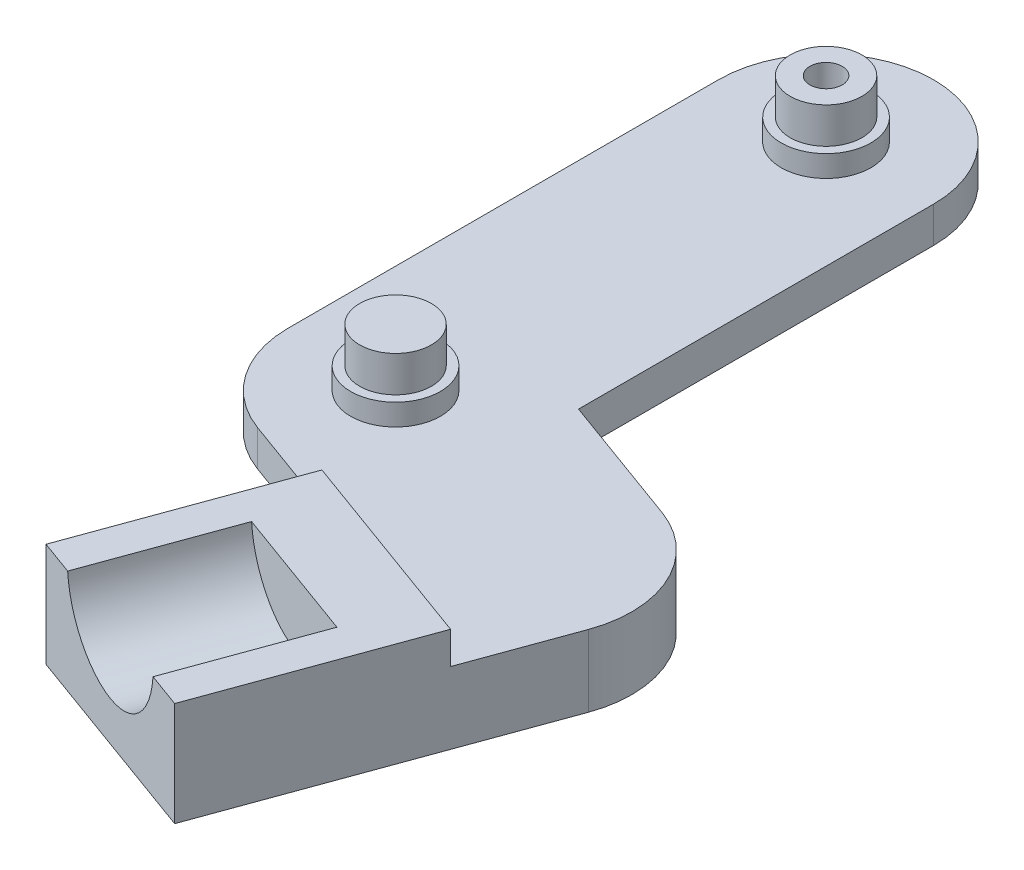
ISO-10303-21;
HEADER;
FILE_DESCRIPTION(('STEP AP214'),'2;1');
FILE_NAME('part.step','',(''),(''),'','','');
FILE_SCHEMA(('AUTOMOTIVE_DESIGN { 1 0 10303 214 1 1 1 1 }'));
ENDSEC;
DATA;
#1=APPLICATION_CONTEXT('core data for automotive mechanical design processes');
#2=APPLICATION_PROTOCOL_DEFINITION('international standard','automotive_design',2000,#1);
#3=PRODUCT_CONTEXT('',#1,'mechanical');
#4=PRODUCT('Part','Part','',(#3));
#5=PRODUCT_RELATED_PRODUCT_CATEGORY('part','',(#4));
#6=PRODUCT_DEFINITION_FORMATION('','',#4);
#7=PRODUCT_DEFINITION_CONTEXT('part definition',#1,'design');
#8=PRODUCT_DEFINITION('design','',#6,#7);
#9=PRODUCT_DEFINITION_SHAPE('','',#8);
#10=(LENGTH_UNIT() NAMED_UNIT(*) SI_UNIT(.MILLI.,.METRE.));
#11=(NAMED_UNIT(*) PLANE_ANGLE_UNIT() SI_UNIT($,.RADIAN.));
#12=(NAMED_UNIT(*) SI_UNIT($,.STERADIAN.) SOLID_ANGLE_UNIT());
#13=UNCERTAINTY_MEASURE_WITH_UNIT(LENGTH_MEASURE(1.E-05),#10,'distance_accuracy_value','');
#14=(GEOMETRIC_REPRESENTATION_CONTEXT(3) GLOBAL_UNCERTAINTY_ASSIGNED_CONTEXT((#13)) GLOBAL_UNIT_ASSIGNED_CONTEXT((#10,
#11,#12)) REPRESENTATION_CONTEXT('',''));
#15=CARTESIAN_POINT('',(0.,0.,0.));
#16=DIRECTION('',(0.,0.,1.));
#17=DIRECTION('',(1.,0.,0.));
#18=AXIS2_PLACEMENT_3D('',#15,#16,#17);
#19=CARTESIAN_POINT('',(0.,5.,-60.));
#20=DIRECTION('',(0.,1.,0.));
#21=DIRECTION('',(0.,0.,1.));
#22=AXIS2_PLACEMENT_3D('',#19,#20,#21);
#23=PLANE('',#22);
#24=CARTESIAN_POINT('',(0.,5.,0.));
#25=DIRECTION('',(0.,1.,0.));
#26=DIRECTION('',(0.,0.,1.));
#27=AXIS2_PLACEMENT_3D('',#24,#25,#26);
#28=CIRCLE('',#27,6.25000000000001);
#29=CARTESIAN_POINT('',(0.,5.,6.25000000000001));
#30=VERTEX_POINT('',#29);
#31=EDGE_CURVE('E241',#30,#30,#28,.T.);
#32=ORIENTED_EDGE('',*,*,#31,.F.);
#33=EDGE_LOOP('',(#32));
#34=FACE_BOUND('',#33,.T.);
#35=CARTESIAN_POINT('',(0.,5.,-60.));
#36=DIRECTION('',(0.,1.,0.));
#37=DIRECTION('',(0.,0.,1.));
#38=AXIS2_PLACEMENT_3D('',#35,#36,#37);
#39=CIRCLE('',#38,6.25000000000001);
#40=CARTESIAN_POINT('',(0.,5.,-53.75));
#41=VERTEX_POINT('',#40);
#42=EDGE_CURVE('E248',#41,#41,#39,.T.);
#43=ORIENTED_EDGE('',*,*,#42,.F.);
#44=EDGE_LOOP('',(#43));
#45=FACE_BOUND('',#44,.T.);
#46=DIRECTION('',(-0.939692620785907,0.,-0.342020143325673));
#47=VECTOR('',#46,1.);
#48=CARTESIAN_POINT('',(-5.13030214988509,5.,14.0953893117886));
#49=LINE('',#48,#47);
#50=CARTESIAN_POINT('',(8.96508716190355,5.,19.2256914616737));
#51=VERTEX_POINT('',#50);
#52=CARTESIAN_POINT('',(-5.13030214988509,5.,14.0953893117886));
#53=VERTEX_POINT('',#52);
#54=EDGE_CURVE('E206',#51,#53,#49,.T.);
#55=ORIENTED_EDGE('',*,*,#54,.F.);
#56=DIRECTION('',(-0.939692620785908,0.,-0.34202014332567));
#57=VECTOR('',#56,1.);
#58=CARTESIAN_POINT('',(8.96508716190355,5.,19.2256914616737));
#59=LINE('',#58,#57);
#60=CARTESIAN_POINT('',(37.1558657854808,5.,29.4862957614438));
#61=VERTEX_POINT('',#60);
#62=EDGE_CURVE('E163',#61,#51,#59,.T.);
#63=ORIENTED_EDGE('',*,*,#62,.F.);
#64=DIRECTION('',(-0.34202014332567,0.,0.939692620785908));
#65=VECTOR('',#64,1.);
#66=CARTESIAN_POINT('',(42.2861679353658,5.,15.3909064496552));
#67=LINE('',#66,#65);
#68=CARTESIAN_POINT('',(42.2861679353658,5.,15.3909064496552));
#69=VERTEX_POINT('',#68);
#70=EDGE_CURVE('E174',#69,#61,#67,.T.);
#71=ORIENTED_EDGE('',*,*,#70,.F.);
#72=CARTESIAN_POINT('',(28.1907786235772,5.,10.2606042997702));
#73=DIRECTION('',(0.,-1.,0.));
#74=DIRECTION('',(0.,0.,-1.));
#75=AXIS2_PLACEMENT_3D('',#72,#73,#74);
#76=CIRCLE('',#75,15.);
#77=CARTESIAN_POINT('',(33.3210807734623,5.,-3.83478501201842));
#78=VERTEX_POINT('',#77);
#79=EDGE_CURVE('E202',#78,#69,#76,.T.);
#80=ORIENTED_EDGE('',*,*,#79,.F.);
#81=DIRECTION('',(0.939692620785907,0.,0.342020143325673));
#82=VECTOR('',#81,1.);
#83=CARTESIAN_POINT('',(15.,5.,-10.5031130731456));
#84=LINE('',#83,#82);
#85=CARTESIAN_POINT('',(15.,5.,-10.5031130731456));
#86=VERTEX_POINT('',#85);
#87=EDGE_CURVE('E199',#86,#78,#84,.T.);
#88=ORIENTED_EDGE('',*,*,#87,.F.);
#89=DIRECTION('',(0.,0.,-1.));
#90=VECTOR('',#89,1.);
#91=CARTESIAN_POINT('',(15.,5.,0.));
#92=LINE('',#91,#90);
#93=CARTESIAN_POINT('',(15.,5.,-60.));
#94=VERTEX_POINT('',#93);
#95=EDGE_CURVE('E257',#86,#94,#92,.T.);
#96=ORIENTED_EDGE('',*,*,#95,.T.);
#97=CARTESIAN_POINT('',(0.,5.,-60.));
#98=DIRECTION('',(0.,1.,0.));
#99=DIRECTION('',(0.,0.,1.));
#100=AXIS2_PLACEMENT_3D('',#97,#98,#99);
#101=CIRCLE('',#100,15.);
#102=CARTESIAN_POINT('',(-15.,5.,-60.));
#103=VERTEX_POINT('',#102);
#104=EDGE_CURVE('E259',#94,#103,#101,.T.);
#105=ORIENTED_EDGE('',*,*,#104,.T.);
#106=DIRECTION('',(0.,0.,-1.));
#107=VECTOR('',#106,1.);
#108=CARTESIAN_POINT('',(-15.,5.,0.));
#109=LINE('',#108,#107);
#110=CARTESIAN_POINT('',(-15.,5.,0.));
#111=VERTEX_POINT('',#110);
#112=EDGE_CURVE('E262',#111,#103,#109,.T.);
#113=ORIENTED_EDGE('',*,*,#112,.F.);
#114=CARTESIAN_POINT('',(0.,5.,0.));
#115=DIRECTION('',(0.,1.,0.));
#116=DIRECTION('',(0.,0.,1.));
#117=AXIS2_PLACEMENT_3D('',#114,#115,#116);
#118=CIRCLE('',#117,15.);
#119=EDGE_CURVE('E265',#111,#53,#118,.T.);
#120=ORIENTED_EDGE('',*,*,#119,.T.);
#121=EDGE_LOOP('',(#55,#63,#71,#80,#88,#96,#105,#113,#120));
#122=FACE_BOUND('',#121,.T.);
#123=ADVANCED_FACE('F35',(#34,#45,#122),#23,.T.);
#124=CARTESIAN_POINT('',(0.,0.,-60.));
#125=DIRECTION('',(0.,1.,0.));
#126=DIRECTION('',(0.,0.,1.));
#127=AXIS2_PLACEMENT_3D('',#124,#125,#126);
#128=PLANE('',#127);
#129=CARTESIAN_POINT('',(0.,0.,-60.));
#130=DIRECTION('',(0.,-1.,0.));
#131=DIRECTION('',(0.,0.,-1.));
#132=AXIS2_PLACEMENT_3D('',#129,#130,#131);
#133=CIRCLE('',#132,4.49999999999999);
#134=CARTESIAN_POINT('',(0.,0.,-64.5));
#135=VERTEX_POINT('',#134);
#136=EDGE_CURVE('E214',#135,#135,#133,.T.);
#137=ORIENTED_EDGE('',*,*,#136,.F.);
#138=EDGE_LOOP('',(#137));
#139=FACE_BOUND('',#138,.T.);
#140=CARTESIAN_POINT('',(28.1907786235772,0.,10.2606042997702));
#141=DIRECTION('',(0.,1.,0.));
#142=DIRECTION('',(0.,0.,1.));
#143=AXIS2_PLACEMENT_3D('',#140,#141,#142);
#144=CIRCLE('',#143,15.);
#145=CARTESIAN_POINT('',(14.0953893117886,0.,5.13030214988514));
#146=VERTEX_POINT('',#145);
#147=CARTESIAN_POINT('',(33.3210807734623,0.,-3.83478501201842));
#148=VERTEX_POINT('',#147);
#149=EDGE_CURVE('E57',#146,#148,#144,.F.);
#150=ORIENTED_EDGE('',*,*,#149,.F.);
#151=DIRECTION('',(0.342020143325669,0.,-0.939692620785908));
#152=VECTOR('',#151,1.);
#153=CARTESIAN_POINT('',(33.3790176023848,0.,-47.8510311436843));
#154=LINE('',#153,#152);
#155=CARTESIAN_POINT('',(8.96508716190356,0.,19.2256914616737));
#156=VERTEX_POINT('',#155);
#157=EDGE_CURVE('E196',#156,#146,#154,.T.);
#158=ORIENTED_EDGE('',*,*,#157,.F.);
#159=DIRECTION('',(-0.939692620785907,0.,-0.342020143325673));
#160=VECTOR('',#159,1.);
#161=CARTESIAN_POINT('',(-5.13030214988509,0.,14.0953893117886));
#162=LINE('',#161,#160);
#163=CARTESIAN_POINT('',(-5.13030214988509,0.,14.0953893117886));
#164=VERTEX_POINT('',#163);
#165=EDGE_CURVE('E203',#156,#164,#162,.T.);
#166=ORIENTED_EDGE('',*,*,#165,.T.);
#167=CARTESIAN_POINT('',(0.,0.,0.));
#168=DIRECTION('',(0.,1.,0.));
#169=DIRECTION('',(0.,0.,1.));
#170=AXIS2_PLACEMENT_3D('',#167,#168,#169);
#171=CIRCLE('',#170,15.);
#172=CARTESIAN_POINT('',(-15.,0.,0.));
#173=VERTEX_POINT('',#172);
#174=EDGE_CURVE('E260',#173,#164,#171,.T.);
#175=ORIENTED_EDGE('',*,*,#174,.F.);
#176=DIRECTION('',(0.,0.,-1.));
#177=VECTOR('',#176,1.);
#178=CARTESIAN_POINT('',(-15.,0.,0.));
#179=LINE('',#178,#177);
#180=CARTESIAN_POINT('',(-15.,0.,-60.));
#181=VERTEX_POINT('',#180);
#182=EDGE_CURVE('E273',#173,#181,#179,.T.);
#183=ORIENTED_EDGE('',*,*,#182,.T.);
#184=CARTESIAN_POINT('',(0.,0.,-60.));
#185=DIRECTION('',(0.,1.,0.));
#186=DIRECTION('',(0.,0.,1.));
#187=AXIS2_PLACEMENT_3D('',#184,#185,#186);
#188=CIRCLE('',#187,15.);
#189=CARTESIAN_POINT('',(15.,0.,-60.));
#190=VERTEX_POINT('',#189);
#191=EDGE_CURVE('E270',#190,#181,#188,.T.);
#192=ORIENTED_EDGE('',*,*,#191,.F.);
#193=DIRECTION('',(0.,0.,-1.));
#194=VECTOR('',#193,1.);
#195=CARTESIAN_POINT('',(15.,0.,0.));
#196=LINE('',#195,#194);
#197=CARTESIAN_POINT('',(15.,0.,-10.5031130731456));
#198=VERTEX_POINT('',#197);
#199=EDGE_CURVE('E254',#198,#190,#196,.T.);
#200=ORIENTED_EDGE('',*,*,#199,.F.);
#201=DIRECTION('',(0.939692620785907,0.,0.342020143325673));
#202=VECTOR('',#201,1.);
#203=CARTESIAN_POINT('',(15.,0.,-10.5031130731456));
#204=LINE('',#203,#202);
#205=EDGE_CURVE('E198',#198,#148,#204,.T.);
#206=ORIENTED_EDGE('',*,*,#205,.T.);
#207=EDGE_LOOP('',(#150,#158,#166,#175,#183,#192,#200,#206));
#208=FACE_BOUND('',#207,.T.);
#209=ADVANCED_FACE('F323',(#139,#208),#128,.F.);
#210=CARTESIAN_POINT('',(-5.13030214988509,5.,14.0953893117886));
#211=DIRECTION('',(-0.342020143325673,0.,0.939692620785907));
#212=DIRECTION('',(0.939692620785907,0.,0.342020143325673));
#213=AXIS2_PLACEMENT_3D('',#210,#211,#212);
#214=PLANE('',#213);
#215=ORIENTED_EDGE('',*,*,#165,.F.);
#216=DIRECTION('',(0.,1.,0.));
#217=VECTOR('',#216,1.);
#218=CARTESIAN_POINT('',(8.96508716190356,5.,19.2256914616737));
#219=LINE('',#218,#217);
#220=EDGE_CURVE('E237',#156,#51,#219,.T.);
#221=ORIENTED_EDGE('',*,*,#220,.T.);
#222=ORIENTED_EDGE('',*,*,#54,.T.);
#223=DIRECTION('',(0.,-1.,0.));
#224=VECTOR('',#223,1.);
#225=CARTESIAN_POINT('',(-5.13030214988509,5.,14.0953893117886));
#226=LINE('',#225,#224);
#227=EDGE_CURVE('E211',#53,#164,#226,.T.);
#228=ORIENTED_EDGE('',*,*,#227,.T.);
#229=EDGE_LOOP('',(#215,#221,#222,#228));
#230=FACE_BOUND('',#229,.T.);
#231=ADVANCED_FACE('F318',(#230),#214,.T.);
#232=CARTESIAN_POINT('',(0.,5.,0.));
#233=DIRECTION('',(0.,-1.,0.));
#234=DIRECTION('',(0.,0.,-1.));
#235=AXIS2_PLACEMENT_3D('',#232,#233,#234);
#236=CYLINDRICAL_SURFACE('',#235,15.);
#237=ORIENTED_EDGE('',*,*,#227,.F.);
#238=ORIENTED_EDGE('',*,*,#119,.F.);
#239=DIRECTION('',(0.,-1.,0.));
#240=VECTOR('',#239,1.);
#241=CARTESIAN_POINT('',(-15.,5.,0.));
#242=LINE('',#241,#240);
#243=EDGE_CURVE('E268',#111,#173,#242,.T.);
#244=ORIENTED_EDGE('',*,*,#243,.T.);
#245=ORIENTED_EDGE('',*,*,#174,.T.);
#246=EDGE_LOOP('',(#237,#238,#244,#245));
#247=FACE_BOUND('',#246,.T.);
#248=ADVANCED_FACE('F320',(#247),#236,.T.);
#249=CARTESIAN_POINT('',(15.,5.,0.));
#250=DIRECTION('',(-1.,0.,0.));
#251=DIRECTION('',(0.,0.,1.));
#252=AXIS2_PLACEMENT_3D('',#249,#250,#251);
#253=PLANE('',#252);
#254=ORIENTED_EDGE('',*,*,#95,.F.);
#255=DIRECTION('',(0.,-1.,0.));
#256=VECTOR('',#255,1.);
#257=CARTESIAN_POINT('',(15.,5.,-10.5031130731456));
#258=LINE('',#257,#256);
#259=EDGE_CURVE('E208',#86,#198,#258,.T.);
#260=ORIENTED_EDGE('',*,*,#259,.T.);
#261=ORIENTED_EDGE('',*,*,#199,.T.);
#262=DIRECTION('',(0.,-1.,0.));
#263=VECTOR('',#262,1.);
#264=CARTESIAN_POINT('',(15.,5.,-60.));
#265=LINE('',#264,#263);
#266=EDGE_CURVE('E244',#94,#190,#265,.T.);
#267=ORIENTED_EDGE('',*,*,#266,.F.);
#268=EDGE_LOOP('',(#254,#260,#261,#267));
#269=FACE_BOUND('',#268,.T.);
#270=ADVANCED_FACE('F37',(#269),#253,.F.);
#271=CARTESIAN_POINT('',(0.,5.,-60.));
#272=DIRECTION('',(0.,-1.,0.));
#273=DIRECTION('',(0.,0.,-1.));
#274=AXIS2_PLACEMENT_3D('',#271,#272,#273);
#275=CYLINDRICAL_SURFACE('',#274,15.);
#276=ORIENTED_EDGE('',*,*,#191,.T.);
#277=DIRECTION('',(0.,-1.,0.));
#278=VECTOR('',#277,1.);
#279=CARTESIAN_POINT('',(-15.,5.,-60.));
#280=LINE('',#279,#278);
#281=EDGE_CURVE('E279',#103,#181,#280,.T.);
#282=ORIENTED_EDGE('',*,*,#281,.F.);
#283=ORIENTED_EDGE('',*,*,#104,.F.);
#284=ORIENTED_EDGE('',*,*,#266,.T.);
#285=EDGE_LOOP('',(#276,#282,#283,#284));
#286=FACE_BOUND('',#285,.T.);
#287=ADVANCED_FACE('F330',(#286),#275,.T.);
#288=CARTESIAN_POINT('',(-15.,5.,0.));
#289=DIRECTION('',(-1.,0.,0.));
#290=DIRECTION('',(0.,0.,1.));
#291=AXIS2_PLACEMENT_3D('',#288,#289,#290);
#292=PLANE('',#291);
#293=ORIENTED_EDGE('',*,*,#182,.F.);
#294=ORIENTED_EDGE('',*,*,#243,.F.);
#295=ORIENTED_EDGE('',*,*,#112,.T.);
#296=ORIENTED_EDGE('',*,*,#281,.T.);
#297=EDGE_LOOP('',(#293,#294,#295,#296));
#298=FACE_BOUND('',#297,.T.);
#299=ADVANCED_FACE('F326',(#298),#292,.T.);
#300=CARTESIAN_POINT('',(0.,8.,-60.));
#301=DIRECTION('',(0.,-1.,0.));
#302=DIRECTION('',(0.,0.,-1.));
#303=AXIS2_PLACEMENT_3D('',#300,#301,#302);
#304=CYLINDRICAL_SURFACE('',#303,6.25000000000001);
#305=CARTESIAN_POINT('',(0.,8.,-60.));
#306=DIRECTION('',(0.,1.,0.));
#307=DIRECTION('',(0.,0.,1.));
#308=AXIS2_PLACEMENT_3D('',#305,#306,#307);
#309=CIRCLE('',#308,6.25000000000001);
#310=CARTESIAN_POINT('',(0.,8.,-53.75));
#311=VERTEX_POINT('',#310);
#312=EDGE_CURVE('E251',#311,#311,#309,.T.);
#313=ORIENTED_EDGE('',*,*,#312,.F.);
#314=EDGE_LOOP('',(#313));
#315=FACE_BOUND('',#314,.T.);
#316=ORIENTED_EDGE('',*,*,#42,.T.);
#317=EDGE_LOOP('',(#316));
#318=FACE_BOUND('',#317,.T.);
#319=ADVANCED_FACE('F358',(#315,#318),#304,.T.);
#320=CARTESIAN_POINT('',(0.,8.,-60.));
#321=DIRECTION('',(0.,1.,0.));
#322=DIRECTION('',(0.,0.,1.));
#323=AXIS2_PLACEMENT_3D('',#320,#321,#322);
#324=PLANE('',#323);
#325=CARTESIAN_POINT('',(0.,8.,-60.));
#326=DIRECTION('',(0.,1.,0.));
#327=DIRECTION('',(0.,0.,1.));
#328=AXIS2_PLACEMENT_3D('',#325,#326,#327);
#329=CIRCLE('',#328,5.00000000000001);
#330=CARTESIAN_POINT('',(0.,8.,-55.));
#331=VERTEX_POINT('',#330);
#332=EDGE_CURVE('E238',#331,#331,#329,.T.);
#333=ORIENTED_EDGE('',*,*,#332,.F.);
#334=EDGE_LOOP('',(#333));
#335=FACE_BOUND('',#334,.T.);
#336=ORIENTED_EDGE('',*,*,#312,.T.);
#337=EDGE_LOOP('',(#336));
#338=FACE_BOUND('',#337,.T.);
#339=ADVANCED_FACE('F573',(#335,#338),#324,.T.);
#340=CARTESIAN_POINT('',(0.,8.,0.));
#341=DIRECTION('',(0.,-1.,0.));
#342=DIRECTION('',(0.,0.,-1.));
#343=AXIS2_PLACEMENT_3D('',#340,#341,#342);
#344=CYLINDRICAL_SURFACE('',#343,6.25000000000001);
#345=CARTESIAN_POINT('',(0.,8.,0.));
#346=DIRECTION('',(0.,1.,0.));
#347=DIRECTION('',(0.,0.,1.));
#348=AXIS2_PLACEMENT_3D('',#345,#346,#347);
#349=CIRCLE('',#348,6.25000000000001);
#350=CARTESIAN_POINT('',(0.,8.,6.25000000000001));
#351=VERTEX_POINT('',#350);
#352=EDGE_CURVE('E245',#351,#351,#349,.T.);
#353=ORIENTED_EDGE('',*,*,#352,.F.);
#354=EDGE_LOOP('',(#353));
#355=FACE_BOUND('',#354,.T.);
#356=ORIENTED_EDGE('',*,*,#31,.T.);
#357=EDGE_LOOP('',(#356));
#358=FACE_BOUND('',#357,.T.);
#359=ADVANCED_FACE('F563',(#355,#358),#344,.T.);
#360=CARTESIAN_POINT('',(0.,8.,0.));
#361=DIRECTION('',(0.,1.,0.));
#362=DIRECTION('',(0.,0.,1.));
#363=AXIS2_PLACEMENT_3D('',#360,#361,#362);
#364=PLANE('',#363);
#365=CARTESIAN_POINT('',(0.,8.,0.));
#366=DIRECTION('',(0.,1.,0.));
#367=DIRECTION('',(0.,0.,1.));
#368=AXIS2_PLACEMENT_3D('',#365,#366,#367);
#369=CIRCLE('',#368,5.00000000000001);
#370=CARTESIAN_POINT('',(0.,8.,5.00000000000001));
#371=VERTEX_POINT('',#370);
#372=EDGE_CURVE('E234',#371,#371,#369,.T.);
#373=ORIENTED_EDGE('',*,*,#372,.F.);
#374=EDGE_LOOP('',(#373));
#375=FACE_BOUND('',#374,.T.);
#376=ORIENTED_EDGE('',*,*,#352,.T.);
#377=EDGE_LOOP('',(#376));
#378=FACE_BOUND('',#377,.T.);
#379=ADVANCED_FACE('F554',(#375,#378),#364,.T.);
#380=CARTESIAN_POINT('',(0.,13.,-60.));
#381=DIRECTION('',(0.,-1.,0.));
#382=DIRECTION('',(0.,0.,-1.));
#383=AXIS2_PLACEMENT_3D('',#380,#381,#382);
#384=CYLINDRICAL_SURFACE('',#383,5.00000000000001);
#385=CARTESIAN_POINT('',(0.,13.,-60.));
#386=DIRECTION('',(0.,1.,0.));
#387=DIRECTION('',(0.,0.,1.));
#388=AXIS2_PLACEMENT_3D('',#385,#386,#387);
#389=CIRCLE('',#388,5.00000000000001);
#390=CARTESIAN_POINT('',(0.,13.,-55.));
#391=VERTEX_POINT('',#390);
#392=EDGE_CURVE('E233',#391,#391,#389,.T.);
#393=ORIENTED_EDGE('',*,*,#392,.F.);
#394=EDGE_LOOP('',(#393));
#395=FACE_BOUND('',#394,.T.);
#396=ORIENTED_EDGE('',*,*,#332,.T.);
#397=EDGE_LOOP('',(#396));
#398=FACE_BOUND('',#397,.T.);
#399=ADVANCED_FACE('F546',(#395,#398),#384,.T.);
#400=CARTESIAN_POINT('',(0.,13.,-60.));
#401=DIRECTION('',(0.,1.,0.));
#402=DIRECTION('',(0.,0.,1.));
#403=AXIS2_PLACEMENT_3D('',#400,#401,#402);
#404=PLANE('',#403);
#405=CARTESIAN_POINT('',(0.,13.,-60.));
#406=DIRECTION('',(0.,-1.,0.));
#407=DIRECTION('',(0.,0.,-1.));
#408=AXIS2_PLACEMENT_3D('',#405,#406,#407);
#409=CIRCLE('',#408,2.25);
#410=CARTESIAN_POINT('',(0.,13.,-62.25));
#411=VERTEX_POINT('',#410);
#412=EDGE_CURVE('E227',#411,#411,#409,.T.);
#413=ORIENTED_EDGE('',*,*,#412,.T.);
#414=EDGE_LOOP('',(#413));
#415=FACE_BOUND('',#414,.T.);
#416=ORIENTED_EDGE('',*,*,#392,.T.);
#417=EDGE_LOOP('',(#416));
#418=FACE_BOUND('',#417,.T.);
#419=ADVANCED_FACE('F537',(#415,#418),#404,.T.);
#420=CARTESIAN_POINT('',(0.,13.,0.));
#421=DIRECTION('',(0.,-1.,0.));
#422=DIRECTION('',(0.,0.,-1.));
#423=AXIS2_PLACEMENT_3D('',#420,#421,#422);
#424=CYLINDRICAL_SURFACE('',#423,5.00000000000001);
#425=CARTESIAN_POINT('',(0.,13.,0.));
#426=DIRECTION('',(0.,1.,0.));
#427=DIRECTION('',(0.,0.,1.));
#428=AXIS2_PLACEMENT_3D('',#425,#426,#427);
#429=CIRCLE('',#428,5.00000000000001);
#430=CARTESIAN_POINT('',(0.,13.,5.00000000000001));
#431=VERTEX_POINT('',#430);
#432=EDGE_CURVE('E230',#431,#431,#429,.T.);
#433=ORIENTED_EDGE('',*,*,#432,.F.);
#434=EDGE_LOOP('',(#433));
#435=FACE_BOUND('',#434,.T.);
#436=ORIENTED_EDGE('',*,*,#372,.T.);
#437=EDGE_LOOP('',(#436));
#438=FACE_BOUND('',#437,.T.);
#439=ADVANCED_FACE('F528',(#435,#438),#424,.T.);
#440=CARTESIAN_POINT('',(0.,13.,0.));
#441=DIRECTION('',(0.,1.,0.));
#442=DIRECTION('',(0.,0.,1.));
#443=AXIS2_PLACEMENT_3D('',#440,#441,#442);
#444=PLANE('',#443);
#445=ORIENTED_EDGE('',*,*,#432,.T.);
#446=EDGE_LOOP('',(#445));
#447=FACE_BOUND('',#446,.T.);
#448=ADVANCED_FACE('F518',(#447),#444,.T.);
#449=CARTESIAN_POINT('',(0.,0.,-60.));
#450=DIRECTION('',(0.,-1.,0.));
#451=DIRECTION('',(0.,0.,-1.));
#452=AXIS2_PLACEMENT_3D('',#449,#450,#451);
#453=CYLINDRICAL_SURFACE('',#452,2.25);
#454=ORIENTED_EDGE('',*,*,#412,.F.);
#455=EDGE_LOOP('',(#454));
#456=FACE_BOUND('',#455,.T.);
#457=CARTESIAN_POINT('',(0.,4.,-60.));
#458=DIRECTION('',(0.,-1.,0.));
#459=DIRECTION('',(0.,0.,-1.));
#460=AXIS2_PLACEMENT_3D('',#457,#458,#459);
#461=CIRCLE('',#460,2.25);
#462=CARTESIAN_POINT('',(0.,4.,-62.25));
#463=VERTEX_POINT('',#462);
#464=EDGE_CURVE('E224',#463,#463,#461,.T.);
#465=ORIENTED_EDGE('',*,*,#464,.T.);
#466=EDGE_LOOP('',(#465));
#467=FACE_BOUND('',#466,.T.);
#468=ADVANCED_FACE('F509',(#456,#467),#453,.F.);
#469=CARTESIAN_POINT('',(2.25,4.,-60.));
#470=DIRECTION('',(0.,1.,0.));
#471=DIRECTION('',(0.,0.,1.));
#472=AXIS2_PLACEMENT_3D('',#469,#470,#471);
#473=PLANE('',#472);
#474=ORIENTED_EDGE('',*,*,#464,.F.);
#475=EDGE_LOOP('',(#474));
#476=FACE_BOUND('',#475,.T.);
#477=CARTESIAN_POINT('',(0.,4.,-60.));
#478=DIRECTION('',(0.,-1.,0.));
#479=DIRECTION('',(0.,0.,-1.));
#480=AXIS2_PLACEMENT_3D('',#477,#478,#479);
#481=CIRCLE('',#480,4.5);
#482=CARTESIAN_POINT('',(0.,4.,-64.5));
#483=VERTEX_POINT('',#482);
#484=EDGE_CURVE('E221',#483,#483,#481,.T.);
#485=ORIENTED_EDGE('',*,*,#484,.T.);
#486=EDGE_LOOP('',(#485));
#487=FACE_BOUND('',#486,.T.);
#488=ADVANCED_FACE('F501',(#476,#487),#473,.F.);
#489=CARTESIAN_POINT('',(0.,0.,-60.));
#490=DIRECTION('',(0.,-1.,0.));
#491=DIRECTION('',(0.,0.,-1.));
#492=AXIS2_PLACEMENT_3D('',#489,#490,#491);
#493=CYLINDRICAL_SURFACE('',#492,4.5);
#494=ORIENTED_EDGE('',*,*,#484,.F.);
#495=EDGE_LOOP('',(#494));
#496=FACE_BOUND('',#495,.T.);
#497=ORIENTED_EDGE('',*,*,#136,.T.);
#498=EDGE_LOOP('',(#497));
#499=FACE_BOUND('',#498,.T.);
#500=ADVANCED_FACE('F344',(#496,#499),#493,.F.);
#501=CARTESIAN_POINT('',(28.1907786235772,5.,10.2606042997702));
#502=DIRECTION('',(0.,-1.,0.));
#503=DIRECTION('',(0.,0.,-1.));
#504=AXIS2_PLACEMENT_3D('',#501,#502,#503);
#505=CYLINDRICAL_SURFACE('',#504,15.);
#506=ORIENTED_EDGE('',*,*,#79,.T.);
#507=DIRECTION('',(0.,1.,0.));
#508=VECTOR('',#507,1.);
#509=CARTESIAN_POINT('',(42.2861679353658,-5.,15.3909064496552));
#510=LINE('',#509,#508);
#511=CARTESIAN_POINT('',(42.2861679353658,-5.,15.3909064496552));
#512=VERTEX_POINT('',#511);
#513=EDGE_CURVE('E193',#512,#69,#510,.T.);
#514=ORIENTED_EDGE('',*,*,#513,.F.);
#515=CARTESIAN_POINT('',(28.1907786235772,-5.,10.2606042997702));
#516=DIRECTION('',(0.,-1.,0.));
#517=DIRECTION('',(0.,0.,-1.));
#518=AXIS2_PLACEMENT_3D('',#515,#516,#517);
#519=CIRCLE('',#518,15.);
#520=CARTESIAN_POINT('',(14.0953893117886,-5.,5.13030214988514));
#521=VERTEX_POINT('',#520);
#522=EDGE_CURVE('E177',#521,#512,#519,.T.);
#523=ORIENTED_EDGE('',*,*,#522,.F.);
#524=DIRECTION('',(0.,1.,0.));
#525=VECTOR('',#524,1.);
#526=CARTESIAN_POINT('',(14.0953893117886,-5.,5.13030214988514));
#527=LINE('',#526,#525);
#528=EDGE_CURVE('E186',#521,#146,#527,.T.);
#529=ORIENTED_EDGE('',*,*,#528,.T.);
#530=ORIENTED_EDGE('',*,*,#149,.T.);
#531=DIRECTION('',(0.,-1.,0.));
#532=VECTOR('',#531,1.);
#533=CARTESIAN_POINT('',(33.3210807734623,5.,-3.83478501201842));
#534=LINE('',#533,#532);
#535=EDGE_CURVE('E215',#78,#148,#534,.T.);
#536=ORIENTED_EDGE('',*,*,#535,.F.);
#537=EDGE_LOOP('',(#506,#514,#523,#529,#530,#536));
#538=FACE_BOUND('',#537,.T.);
#539=ADVANCED_FACE('F309',(#538),#505,.T.);
#540=CARTESIAN_POINT('',(15.,5.,-10.5031130731456));
#541=DIRECTION('',(0.342020143325673,0.,-0.939692620785907));
#542=DIRECTION('',(-0.939692620785907,0.,-0.342020143325673));
#543=AXIS2_PLACEMENT_3D('',#540,#541,#542);
#544=PLANE('',#543);
#545=ORIENTED_EDGE('',*,*,#205,.F.);
#546=ORIENTED_EDGE('',*,*,#259,.F.);
#547=ORIENTED_EDGE('',*,*,#87,.T.);
#548=ORIENTED_EDGE('',*,*,#535,.T.);
#549=EDGE_LOOP('',(#545,#546,#547,#548));
#550=FACE_BOUND('',#549,.T.);
#551=ADVANCED_FACE('F336',(#550),#544,.T.);
#552=CARTESIAN_POINT('',(14.0953893117886,-5.,5.13030214988514));
#553=DIRECTION('',(0.939692620785908,0.,0.342020143325669));
#554=DIRECTION('',(0.342020143325669,0.,-0.939692620785908));
#555=AXIS2_PLACEMENT_3D('',#552,#553,#554);
#556=PLANE('',#555);
#557=ORIENTED_EDGE('',*,*,#220,.F.);
#558=ORIENTED_EDGE('',*,*,#157,.T.);
#559=ORIENTED_EDGE('',*,*,#528,.F.);
#560=DIRECTION('',(0.342020143325668,0.,-0.939692620785909));
#561=VECTOR('',#560,1.);
#562=CARTESIAN_POINT('',(3.83478501201851,-5.,33.3210807734624));
#563=LINE('',#562,#561);
#564=CARTESIAN_POINT('',(-1.29551713786652,-5.,47.416470085251));
#565=VERTEX_POINT('',#564);
#566=EDGE_CURVE('E184',#565,#521,#563,.T.);
#567=ORIENTED_EDGE('',*,*,#566,.F.);
#568=DIRECTION('',(0.,1.,0.));
#569=VECTOR('',#568,1.);
#570=CARTESIAN_POINT('',(-1.29551713786652,-5.,47.416470085251));
#571=LINE('',#570,#569);
#572=CARTESIAN_POINT('',(-1.29551713786652,9.5,47.416470085251));
#573=VERTEX_POINT('',#572);
#574=EDGE_CURVE('E189',#565,#573,#571,.T.);
#575=ORIENTED_EDGE('',*,*,#574,.T.);
#576=DIRECTION('',(-0.342020143325668,0.,0.939692620785909));
#577=VECTOR('',#576,1.);
#578=CARTESIAN_POINT('',(-1.29551713786652,9.5,47.416470085251));
#579=LINE('',#578,#577);
#580=CARTESIAN_POINT('',(8.96508716190355,9.5,19.2256914616737));
#581=VERTEX_POINT('',#580);
#582=EDGE_CURVE('E158',#581,#573,#579,.T.);
#583=ORIENTED_EDGE('',*,*,#582,.F.);
#584=DIRECTION('',(0.,-1.,0.));
#585=VECTOR('',#584,1.);
#586=CARTESIAN_POINT('',(8.96508716190355,9.5,19.2256914616737));
#587=LINE('',#586,#585);
#588=EDGE_CURVE('E168',#581,#51,#587,.T.);
#589=ORIENTED_EDGE('',*,*,#588,.T.);
#590=EDGE_LOOP('',(#557,#558,#559,#567,#575,#583,#589));
#591=FACE_BOUND('',#590,.T.);
#592=ADVANCED_FACE('F300',(#591),#556,.F.);
#593=CARTESIAN_POINT('',(32.0255636355957,-5.,43.5816850732325));
#594=DIRECTION('',(-0.939692620785908,0.,-0.342020143325671));
#595=DIRECTION('',(-0.342020143325671,0.,0.939692620785908));
#596=AXIS2_PLACEMENT_3D('',#593,#594,#595);
#597=PLANE('',#596);
#598=ORIENTED_EDGE('',*,*,#513,.T.);
#599=ORIENTED_EDGE('',*,*,#70,.T.);
#600=DIRECTION('',(0.,-1.,0.));
#601=VECTOR('',#600,1.);
#602=CARTESIAN_POINT('',(37.1558657854808,9.5,29.4862957614438));
#603=LINE('',#602,#601);
#604=CARTESIAN_POINT('',(37.1558657854808,9.5,29.4862957614438));
#605=VERTEX_POINT('',#604);
#606=EDGE_CURVE('E172',#605,#61,#603,.T.);
#607=ORIENTED_EDGE('',*,*,#606,.F.);
#608=DIRECTION('',(0.34202014332567,0.,-0.939692620785908));
#609=VECTOR('',#608,1.);
#610=CARTESIAN_POINT('',(37.1558657854808,9.5,29.4862957614438));
#611=LINE('',#610,#609);
#612=CARTESIAN_POINT('',(26.8952614857107,9.5,57.6770743850211));
#613=VERTEX_POINT('',#612);
#614=EDGE_CURVE('E159',#613,#605,#611,.T.);
#615=ORIENTED_EDGE('',*,*,#614,.F.);
#616=DIRECTION('',(0.,1.,0.));
#617=VECTOR('',#616,1.);
#618=CARTESIAN_POINT('',(26.8952614857107,-5.,57.6770743850211));
#619=LINE('',#618,#617);
#620=CARTESIAN_POINT('',(26.8952614857107,-5.,57.6770743850211));
#621=VERTEX_POINT('',#620);
#622=EDGE_CURVE('E191',#621,#613,#619,.T.);
#623=ORIENTED_EDGE('',*,*,#622,.F.);
#624=DIRECTION('',(-0.34202014332567,0.,0.939692620785908));
#625=VECTOR('',#624,1.);
#626=CARTESIAN_POINT('',(42.2861679353658,-5.,15.3909064496552));
#627=LINE('',#626,#625);
#628=EDGE_CURVE('E180',#512,#621,#627,.T.);
#629=ORIENTED_EDGE('',*,*,#628,.F.);
#630=EDGE_LOOP('',(#598,#599,#607,#615,#623,#629));
#631=FACE_BOUND('',#630,.T.);
#632=ADVANCED_FACE('F291',(#631),#597,.F.);
#633=CARTESIAN_POINT('',(-1.29551713786652,-5.,47.416470085251));
#634=DIRECTION('',(0.342020143325669,0.,-0.939692620785908));
#635=DIRECTION('',(-0.939692620785908,0.,-0.342020143325669));
#636=AXIS2_PLACEMENT_3D('',#633,#634,#635);
#637=PLANE('',#636);
#638=DIRECTION('',(0.939692620785908,0.,0.342020143325669));
#639=VECTOR('',#638,1.);
#640=CARTESIAN_POINT('',(26.8952614857107,9.5,57.6770743850211));
#641=LINE('',#640,#639);
#642=CARTESIAN_POINT('',(22.1496956981598,9.5,55.9498296936005));
#643=VERTEX_POINT('',#642);
#644=EDGE_CURVE('E153',#643,#613,#641,.T.);
#645=ORIENTED_EDGE('',*,*,#644,.F.);
#646=CARTESIAN_POINT('',(12.7998721739221,10.5,52.546772235136));
#647=DIRECTION('',(-0.342020143325669,0.,0.939692620785908));
#648=DIRECTION('',(0.939692620785908,0.,0.342020143325669));
#649=AXIS2_PLACEMENT_3D('',#646,#647,#648);
#650=CIRCLE('',#649,10.);
#651=CARTESIAN_POINT('',(3.45004864968433,9.5,49.1437147766716));
#652=VERTEX_POINT('',#651);
#653=EDGE_CURVE('E141',#652,#643,#650,.T.);
#654=ORIENTED_EDGE('',*,*,#653,.F.);
#655=EDGE_CURVE('E151',#573,#652,#641,.T.);
#656=ORIENTED_EDGE('',*,*,#655,.F.);
#657=ORIENTED_EDGE('',*,*,#574,.F.);
#658=DIRECTION('',(-0.939692620785908,0.,-0.342020143325669));
#659=VECTOR('',#658,1.);
#660=CARTESIAN_POINT('',(-1.29551713786652,-5.,47.416470085251));
#661=LINE('',#660,#659);
#662=EDGE_CURVE('E182',#621,#565,#661,.T.);
#663=ORIENTED_EDGE('',*,*,#662,.F.);
#664=ORIENTED_EDGE('',*,*,#622,.T.);
#665=EDGE_LOOP('',(#645,#654,#656,#657,#663,#664));
#666=FACE_BOUND('',#665,.T.);
#667=ADVANCED_FACE('F149',(#666),#637,.F.);
#668=CARTESIAN_POINT('',(28.1907786235772,-5.,10.2606042997702));
#669=DIRECTION('',(0.,-1.,0.));
#670=DIRECTION('',(0.,0.,-1.));
#671=AXIS2_PLACEMENT_3D('',#668,#669,#670);
#672=PLANE('',#671);
#673=ORIENTED_EDGE('',*,*,#522,.T.);
#674=ORIENTED_EDGE('',*,*,#628,.T.);
#675=ORIENTED_EDGE('',*,*,#662,.T.);
#676=ORIENTED_EDGE('',*,*,#566,.T.);
#677=EDGE_LOOP('',(#673,#674,#675,#676));
#678=FACE_BOUND('',#677,.T.);
#679=ADVANCED_FACE('F305',(#678),#672,.T.);
#680=CARTESIAN_POINT('',(8.96508716190355,9.5,19.2256914616737));
#681=DIRECTION('',(-0.34202014332567,0.,0.939692620785908));
#682=DIRECTION('',(0.939692620785908,0.,0.34202014332567));
#683=AXIS2_PLACEMENT_3D('',#680,#681,#682);
#684=PLANE('',#683);
#685=ORIENTED_EDGE('',*,*,#62,.T.);
#686=ORIENTED_EDGE('',*,*,#588,.F.);
#687=DIRECTION('',(-0.939692620785908,0.,-0.34202014332567));
#688=VECTOR('',#687,1.);
#689=CARTESIAN_POINT('',(8.96508716190355,9.5,19.2256914616737));
#690=LINE('',#689,#688);
#691=EDGE_CURVE('E161',#605,#581,#690,.T.);
#692=ORIENTED_EDGE('',*,*,#691,.F.);
#693=ORIENTED_EDGE('',*,*,#606,.T.);
#694=EDGE_LOOP('',(#685,#686,#692,#693));
#695=FACE_BOUND('',#694,.T.);
#696=ADVANCED_FACE('F297',(#695),#684,.F.);
#697=CARTESIAN_POINT('',(0.,9.5,0.));
#698=DIRECTION('',(0.,-1.,0.));
#699=DIRECTION('',(0.,0.,-1.));
#700=AXIS2_PLACEMENT_3D('',#697,#698,#699);
#701=PLANE('',#700);
#702=DIRECTION('',(-0.939692620785908,0.,-0.342020143325669));
#703=VECTOR('',#702,1.);
#704=CARTESIAN_POINT('',(-8.55050358314176,9.5,23.4923155196478));
#705=LINE('',#704,#703);
#706=CARTESIAN_POINT('',(28.9900985646732,9.5,37.1559772778823));
#707=VERTEX_POINT('',#706);
#708=CARTESIAN_POINT('',(10.2904515161977,9.5,30.3498623609534));
#709=VERTEX_POINT('',#708);
#710=EDGE_CURVE('E145',#707,#709,#705,.T.);
#711=ORIENTED_EDGE('',*,*,#710,.F.);
#712=DIRECTION('',(-0.342020143325669,0.,0.939692620785908));
#713=VECTOR('',#712,1.);
#714=CARTESIAN_POINT('',(28.9900985646732,9.5,37.1559772778823));
#715=LINE('',#714,#713);
#716=EDGE_CURVE('E11',#707,#643,#715,.T.);
#717=ORIENTED_EDGE('',*,*,#716,.T.);
#718=ORIENTED_EDGE('',*,*,#644,.T.);
#719=ORIENTED_EDGE('',*,*,#614,.T.);
#720=ORIENTED_EDGE('',*,*,#691,.T.);
#721=ORIENTED_EDGE('',*,*,#582,.T.);
#722=ORIENTED_EDGE('',*,*,#655,.T.);
#723=DIRECTION('',(-0.342020143325669,0.,0.939692620785908));
#724=VECTOR('',#723,1.);
#725=CARTESIAN_POINT('',(10.2904515161977,9.5,30.3498623609534));
#726=LINE('',#725,#724);
#727=EDGE_CURVE('E43',#652,#709,#726,.F.);
#728=ORIENTED_EDGE('',*,*,#727,.T.);
#729=EDGE_LOOP('',(#711,#717,#718,#719,#720,#721,#722,#728));
#730=FACE_BOUND('',#729,.T.);
#731=ADVANCED_FACE('F156',(#730),#701,.F.);
#732=CARTESIAN_POINT('',(19.6402750404355,10.5,33.7529198194179));
#733=DIRECTION('',(-0.342020143325669,0.,0.939692620785908));
#734=DIRECTION('',(0.939692620785908,0.,0.342020143325669));
#735=AXIS2_PLACEMENT_3D('',#732,#733,#734);
#736=CYLINDRICAL_SURFACE('',#735,10.);
#737=CARTESIAN_POINT('',(19.6402750404355,10.5,33.7529198194179));
#738=DIRECTION('',(-0.342020143325669,0.,0.939692620785908));
#739=DIRECTION('',(0.939692620785908,0.,0.342020143325669));
#740=AXIS2_PLACEMENT_3D('',#737,#738,#739);
#741=CIRCLE('',#740,10.);
#742=EDGE_CURVE('E49',#709,#707,#741,.T.);
#743=ORIENTED_EDGE('',*,*,#742,.F.);
#744=ORIENTED_EDGE('',*,*,#727,.F.);
#745=ORIENTED_EDGE('',*,*,#653,.T.);
#746=ORIENTED_EDGE('',*,*,#716,.F.);
#747=EDGE_LOOP('',(#743,#744,#745,#746));
#748=FACE_BOUND('',#747,.T.);
#749=ADVANCED_FACE('F140',(#748),#736,.F.);
#750=CARTESIAN_POINT('',(19.6402750404355,10.5,33.7529198194179));
#751=DIRECTION('',(-0.342020143325669,0.,0.939692620785908));
#752=DIRECTION('',(0.939692620785908,0.,0.342020143325669));
#753=AXIS2_PLACEMENT_3D('',#750,#751,#752);
#754=PLANE('',#753);
#755=ORIENTED_EDGE('',*,*,#710,.T.);
#756=ORIENTED_EDGE('',*,*,#742,.T.);
#757=EDGE_LOOP('',(#755,#756));
#758=FACE_BOUND('',#757,.T.);
#759=ADVANCED_FACE('F285',(#758),#754,.T.);
#760=CLOSED_SHELL('',(#123,#209,#231,#248,#270,#287,#299,#319,#339,#359,#379,#399,#419,#439,
#448,#468,#488,#500,#539,#551,#592,#632,#667,#679,#696,#731,#749,#759));
#761=MANIFOLD_SOLID_BREP('B2',#760);
#762=ADVANCED_BREP_SHAPE_REPRESENTATION('',(#18,#761),#14);
#763=SHAPE_DEFINITION_REPRESENTATION(#9,#762);
ENDSEC;
END-ISO-10303-21;
